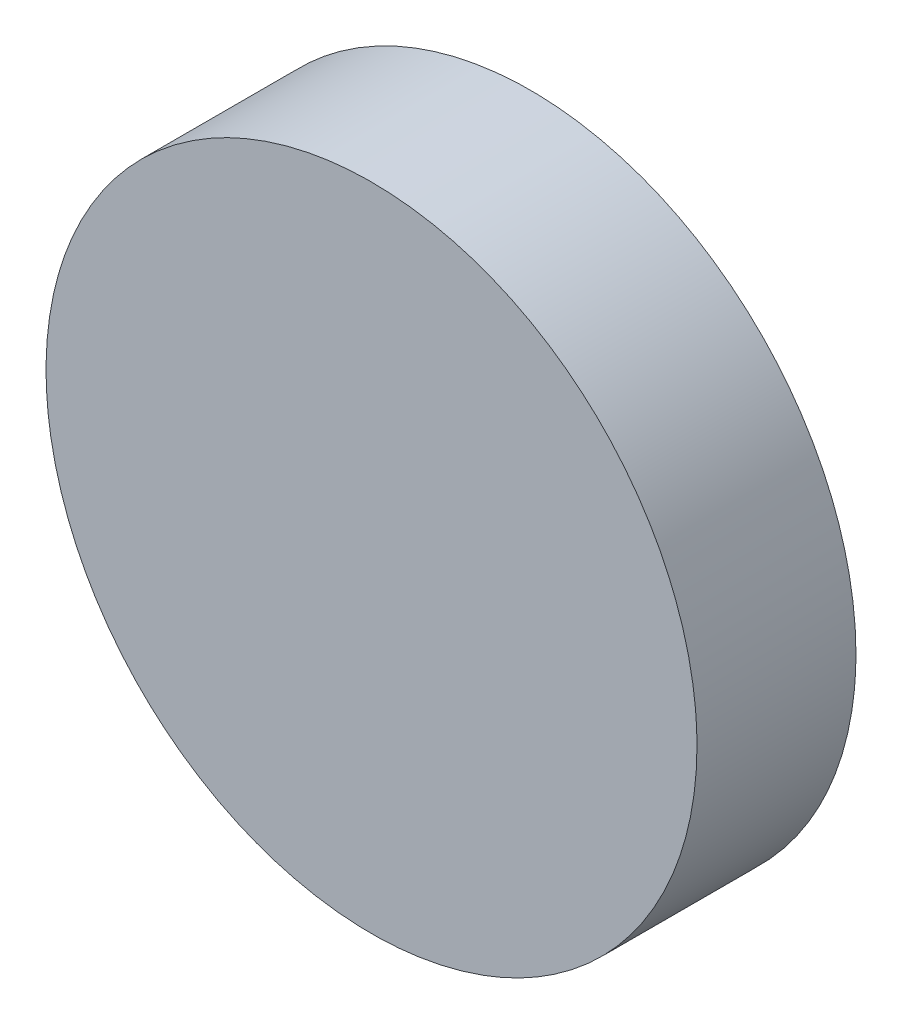
ISO-10303-21;
HEADER;
FILE_DESCRIPTION(('STEP AP214'),'2;1');
FILE_NAME('part.step','',(''),(''),'','','');
FILE_SCHEMA(('AUTOMOTIVE_DESIGN { 1 0 10303 214 1 1 1 1 }'));
ENDSEC;
DATA;
#1=APPLICATION_CONTEXT('core data for automotive mechanical design processes');
#2=APPLICATION_PROTOCOL_DEFINITION('international standard','automotive_design',2000,#1);
#3=PRODUCT_CONTEXT('',#1,'mechanical');
#4=PRODUCT('Part','Part','',(#3));
#5=PRODUCT_RELATED_PRODUCT_CATEGORY('part','',(#4));
#6=PRODUCT_DEFINITION_FORMATION('','',#4);
#7=PRODUCT_DEFINITION_CONTEXT('part definition',#1,'design');
#8=PRODUCT_DEFINITION('design','',#6,#7);
#9=PRODUCT_DEFINITION_SHAPE('','',#8);
#10=(LENGTH_UNIT() NAMED_UNIT(*) SI_UNIT(.MILLI.,.METRE.));
#11=(NAMED_UNIT(*) PLANE_ANGLE_UNIT() SI_UNIT($,.RADIAN.));
#12=(NAMED_UNIT(*) SI_UNIT($,.STERADIAN.) SOLID_ANGLE_UNIT());
#13=UNCERTAINTY_MEASURE_WITH_UNIT(LENGTH_MEASURE(1.E-05),#10,'distance_accuracy_value','');
#14=(GEOMETRIC_REPRESENTATION_CONTEXT(3) GLOBAL_UNCERTAINTY_ASSIGNED_CONTEXT((#13)) GLOBAL_UNIT_ASSIGNED_CONTEXT((#10,
#11,#12)) REPRESENTATION_CONTEXT('',''));
#15=CARTESIAN_POINT('',(0.,0.,0.));
#16=DIRECTION('',(0.,0.,1.));
#17=DIRECTION('',(1.,0.,0.));
#18=AXIS2_PLACEMENT_3D('',#15,#16,#17);
#19=CARTESIAN_POINT('',(15.3503636056791,-25.6015554934087,33.9946065263124));
#20=CARTESIAN_POINT('',(15.3503636056791,-25.3323875266763,33.9946065263124));
#21=CARTESIAN_POINT('',(15.2432819307081,-24.7940515932114,33.9946065263124));
#22=CARTESIAN_POINT('',(14.7858677148132,-24.109482841778,33.9946065263124));
#23=CARTESIAN_POINT('',(14.1012989633798,-23.6520686258831,33.9946065263124));
#24=CARTESIAN_POINT('',(13.2937950631825,-23.4914461134265,33.9946065263124));
#25=CARTESIAN_POINT('',(12.4862911629851,-23.6520686258831,33.9946065263124));
#26=CARTESIAN_POINT('',(11.8017224115517,-24.109482841778,33.9946065263124));
#27=CARTESIAN_POINT('',(11.3443081956568,-24.7940515932114,33.9946065263124));
#28=CARTESIAN_POINT('',(11.1836856832003,-25.6015554934087,33.9946065263124));
#29=CARTESIAN_POINT('',(11.3443081956568,-26.4090593936061,33.9946065263124));
#30=CARTESIAN_POINT('',(11.8017224115517,-27.0936281450395,33.9946065263124));
#31=CARTESIAN_POINT('',(12.4862911629851,-27.5510423609344,33.9946065263124));
#32=CARTESIAN_POINT('',(13.2937950631825,-27.7116648733909,33.9946065263124));
#33=CARTESIAN_POINT('',(14.1012989633798,-27.5510423609344,33.9946065263124));
#34=CARTESIAN_POINT('',(14.7858677148132,-27.0936281450395,33.9946065263124));
#35=CARTESIAN_POINT('',(15.2432819307081,-26.4090593936061,33.9946065263124));
#36=CARTESIAN_POINT('',(15.3503636056791,-25.8707234601412,33.9946065263124));
#37=CARTESIAN_POINT('',(15.3503636056791,-25.6015554934087,33.9946065263124));
#38=B_SPLINE_CURVE_WITH_KNOTS('',3,(#19,#20,#21,#22,#23,#24,#25,#26,#27,#28,#29,#30,#31,#32,#33,
#34,#35,#36,#37),.UNSPECIFIED.,.T.,.F.,(4,1,1,1,1,1,1,1,1,1,1,1,1,1,1,1,4),(0.,0.0625,0.125,
0.1875,0.25,0.3125,0.375,0.4375,0.5,0.5625,0.625,0.6875,0.75,0.8125,0.875,0.9375,1.),.UNSPECIFIED.);
#39=DIRECTION('',(0.,0.,1.));
#40=VECTOR('',#39,1.);
#41=SURFACE_OF_LINEAR_EXTRUSION('',#38,#40);
#42=CARTESIAN_POINT('',(15.3503636056791,-25.6015554934087,33.9946065263124));
#43=CARTESIAN_POINT('',(15.3503636056791,-25.3323875266763,33.9946065263124));
#44=CARTESIAN_POINT('',(15.2432819307081,-24.7940515932114,33.9946065263124));
#45=CARTESIAN_POINT('',(14.7858677148132,-24.109482841778,33.9946065263124));
#46=CARTESIAN_POINT('',(14.1012989633798,-23.6520686258831,33.9946065263124));
#47=CARTESIAN_POINT('',(13.2937950631825,-23.4914461134265,33.9946065263124));
#48=CARTESIAN_POINT('',(12.4862911629851,-23.6520686258831,33.9946065263124));
#49=CARTESIAN_POINT('',(11.8017224115517,-24.109482841778,33.9946065263124));
#50=CARTESIAN_POINT('',(11.3443081956568,-24.7940515932114,33.9946065263124));
#51=CARTESIAN_POINT('',(11.1836856832003,-25.6015554934087,33.9946065263124));
#52=CARTESIAN_POINT('',(11.3443081956568,-26.4090593936061,33.9946065263124));
#53=CARTESIAN_POINT('',(11.8017224115517,-27.0936281450395,33.9946065263124));
#54=CARTESIAN_POINT('',(12.4862911629851,-27.5510423609344,33.9946065263124));
#55=CARTESIAN_POINT('',(13.2937950631825,-27.7116648733909,33.9946065263124));
#56=CARTESIAN_POINT('',(14.1012989633798,-27.5510423609344,33.9946065263124));
#57=CARTESIAN_POINT('',(14.7858677148132,-27.0936281450395,33.9946065263124));
#58=CARTESIAN_POINT('',(15.2432819307081,-26.4090593936061,33.9946065263124));
#59=CARTESIAN_POINT('',(15.3503636056791,-25.8707234601412,33.9946065263124));
#60=CARTESIAN_POINT('',(15.3503636056791,-25.6015554934087,33.9946065263124));
#61=B_SPLINE_CURVE_WITH_KNOTS('',3,(#42,#43,#44,#45,#46,#47,#48,#49,#50,#51,#52,#53,#54,#55,#56,
#57,#58,#59,#60),.UNSPECIFIED.,.T.,.F.,(4,1,1,1,1,1,1,1,1,1,1,1,1,1,1,1,4),(0.,0.0625,0.125,
0.1875,0.25,0.3125,0.375,0.4375,0.5,0.5625,0.625,0.6875,0.75,0.8125,0.875,0.9375,1.),.UNSPECIFIED.);
#62=CARTESIAN_POINT('',(15.3503636056791,-25.6015554934087,33.9946065263124));
#63=VERTEX_POINT('',#62);
#64=EDGE_CURVE('E9',#63,#63,#61,.T.);
#65=ORIENTED_EDGE('',*,*,#64,.T.);
#66=EDGE_LOOP('',(#65));
#67=FACE_BOUND('',#66,.T.);
#68=CARTESIAN_POINT('',(15.3503636056791,-25.6015554934087,34.9990000000068));
#69=CARTESIAN_POINT('',(15.3503636300379,-25.6352022831517,34.9990000000068));
#70=CARTESIAN_POINT('',(15.3495269935284,-25.6688483745142,34.9990000000068));
#71=CARTESIAN_POINT('',(15.346196586481,-25.7360605285312,34.9990000000068));
#72=CARTESIAN_POINT('',(15.3437027184522,-25.7696265863609,34.9990000000068));
#73=CARTESIAN_POINT('',(15.3370738124356,-25.8365983613763,34.9990000000068));
#74=CARTESIAN_POINT('',(15.3329386618263,-25.8700040673998,34.9990000000068));
#75=CARTESIAN_POINT('',(15.323043098035,-25.9365753108456,34.9990000000068));
#76=CARTESIAN_POINT('',(15.3172826147575,-25.9697408378466,34.9990000000068));
#77=CARTESIAN_POINT('',(15.3041522287672,-26.0357517513031,34.9990000000068));
#78=CARTESIAN_POINT('',(15.2967823260544,-26.0685971377587,34.9990000000068));
#79=CARTESIAN_POINT('',(15.2804489160935,-26.1338878282125,34.9990000000068));
#80=CARTESIAN_POINT('',(15.2714854775938,-26.1663331494057,34.9990000000068));
#81=CARTESIAN_POINT('',(15.2519808248614,-26.2307437222432,34.9990000000068));
#82=CARTESIAN_POINT('',(15.241439718946,-26.2627090066795,34.9990000000068));
#83=CARTESIAN_POINT('',(15.218795541295,-26.3260796262804,34.9990000000068));
#84=CARTESIAN_POINT('',(15.2066925614854,-26.3574849942758,34.9990000000068));
#85=CARTESIAN_POINT('',(15.180940732118,-26.4196554100151,34.9990000000068));
#86=CARTESIAN_POINT('',(15.1672918825602,-26.4504204577589,34.9990000000068));
#87=CARTESIAN_POINT('',(15.1384939392235,-26.5112421042255,34.9990000000068));
#88=CARTESIAN_POINT('',(15.1233447572282,-26.5412986611616,34.9990000000068));
#89=CARTESIAN_POINT('',(15.0915914768304,-26.6006356860102,34.9990000000068));
#90=CARTESIAN_POINT('',(15.0749872786485,-26.6299161005181,34.9990000000068));
#91=CARTESIAN_POINT('',(15.0403692527882,-26.6876330561693,34.9990000000068));
#92=CARTESIAN_POINT('',(15.0223553643385,-26.716069560859,34.9990000000068));
#93=CARTESIAN_POINT('',(14.9849631878921,-26.7720309076073,34.9990000000068));
#94=CARTESIAN_POINT('',(14.9655848998955,-26.799555749666,34.9990000000068));
#95=CARTESIAN_POINT('',(14.925509130848,-26.8536259579087,34.9990000000068));
#96=CARTESIAN_POINT('',(14.9048117067321,-26.8801713662879,34.9990000000068));
#97=CARTESIAN_POINT('',(14.8621428982873,-26.9322148684723,34.9990000000068));
#98=CARTESIAN_POINT('',(14.8401716014817,-26.9577130340248,34.9990000000068));
#99=CARTESIAN_POINT('',(14.7950002229733,-27.0075943008858,34.9990000000068));
#100=CARTESIAN_POINT('',(14.7718002136353,-27.0319774677046,34.9990000000068));
#101=CARTESIAN_POINT('',(14.7242170374783,-27.0795606438615,34.9990000000068));
#102=CARTESIAN_POINT('',(14.6998338706595,-27.1027606531996,34.9990000000068));
#103=CARTESIAN_POINT('',(14.6499526037985,-27.147932031708,34.9990000000068));
#104=CARTESIAN_POINT('',(14.624454438246,-27.1699033285136,34.9990000000068));
#105=CARTESIAN_POINT('',(14.5724109360616,-27.2125721369584,34.9990000000068));
#106=CARTESIAN_POINT('',(14.5458655276824,-27.2332695610743,34.9990000000068));
#107=CARTESIAN_POINT('',(14.4917953194397,-27.2733453301218,34.9990000000068));
#108=CARTESIAN_POINT('',(14.464270477381,-27.2927236181184,34.9990000000068));
#109=CARTESIAN_POINT('',(14.4083091306328,-27.3301157945648,34.9990000000068));
#110=CARTESIAN_POINT('',(14.3798726259432,-27.3481296830145,34.9990000000068));
#111=CARTESIAN_POINT('',(14.3221556702916,-27.3827477088748,34.9990000000068));
#112=CARTESIAN_POINT('',(14.2928752557831,-27.3993519070567,34.9990000000068));
#113=CARTESIAN_POINT('',(14.2335382309361,-27.4311051874545,34.9990000000068));
#114=CARTESIAN_POINT('',(14.2034816740021,-27.4462543694499,34.9990000000068));
#115=CARTESIAN_POINT('',(14.1426600275298,-27.4750523127863,34.9990000000068));
#116=CARTESIAN_POINT('',(14.1118949797781,-27.4887011623436,34.9990000000068));
#117=CARTESIAN_POINT('',(14.0497245640602,-27.5144529917123,34.9990000000068));
#118=CARTESIAN_POINT('',(14.0183191960941,-27.5265559715237,34.9990000000068));
#119=CARTESIAN_POINT('',(13.9549485764132,-27.5492001491698,34.9990000000068));
#120=CARTESIAN_POINT('',(13.9229832918677,-27.5597412550786,34.9990000000068));
#121=CARTESIAN_POINT('',(13.8585727193287,-27.5792459078291,34.9990000000068));
#122=CARTESIAN_POINT('',(13.8261273985432,-27.5882093463535,34.9990000000068));
#123=CARTESIAN_POINT('',(13.7608367069754,-27.604542756247,34.9990000000068));
#124=CARTESIAN_POINT('',(13.7279913189978,-27.6119126588679,34.9990000000068));
#125=CARTESIAN_POINT('',(13.6619804096993,-27.6250430451094,34.9990000000068));
#126=CARTESIAN_POINT('',(13.6288148883783,-27.63080352873,34.9990000000068));
#127=CARTESIAN_POINT('',(13.5622436294149,-27.6406990915838,34.9990000000068));
#128=CARTESIAN_POINT('',(13.5288379021952,-27.6448342409127,34.9990000000068));
#129=CARTESIAN_POINT('',(13.4618661850874,-27.6514631504275,34.9990000000068));
#130=CARTESIAN_POINT('',(13.4283002063548,-27.6539570232348,34.9990000000068));
#131=CARTESIAN_POINT('',(13.3610878362444,-27.6572874172275,34.9990000000068));
#132=CARTESIAN_POINT('',(13.3274414497134,-27.6581240359054,34.9990000000068));
#133=CARTESIAN_POINT('',(13.2601486766515,-27.6581240359054,34.9990000000068));
#134=CARTESIAN_POINT('',(13.2265022901205,-27.6572874172276,34.9990000000068));
#135=CARTESIAN_POINT('',(13.1592899200101,-27.6539570232348,34.9990000000068));
#136=CARTESIAN_POINT('',(13.1257239412775,-27.6514631504275,34.9990000000068));
#137=CARTESIAN_POINT('',(13.0587522241697,-27.6448342409127,34.9990000000068));
#138=CARTESIAN_POINT('',(13.02534649695,-27.6406990915838,34.9990000000068));
#139=CARTESIAN_POINT('',(12.9587752379866,-27.63080352873,34.9990000000068));
#140=CARTESIAN_POINT('',(12.9256097166656,-27.6250430451094,34.9990000000068));
#141=CARTESIAN_POINT('',(12.8595988073671,-27.6119126588679,34.9990000000068));
#142=CARTESIAN_POINT('',(12.8267534193895,-27.604542756247,34.9990000000068));
#143=CARTESIAN_POINT('',(12.7614627278217,-27.5882093463535,34.9990000000068));
#144=CARTESIAN_POINT('',(12.7290174070362,-27.5792459078291,34.9990000000068));
#145=CARTESIAN_POINT('',(12.6646068344972,-27.5597412550786,34.9990000000068));
#146=CARTESIAN_POINT('',(12.6326415499517,-27.5492001491698,34.9990000000068));
#147=CARTESIAN_POINT('',(12.5692709302708,-27.5265559715237,34.9990000000068));
#148=CARTESIAN_POINT('',(12.5378655623047,-27.5144529917123,34.9990000000068));
#149=CARTESIAN_POINT('',(12.4756951465868,-27.4887011623436,34.9990000000068));
#150=CARTESIAN_POINT('',(12.4449300988351,-27.4750523127863,34.9990000000068));
#151=CARTESIAN_POINT('',(12.3841084523628,-27.4462543694499,34.9990000000068));
#152=CARTESIAN_POINT('',(12.3540518954288,-27.4311051874545,34.9990000000068));
#153=CARTESIAN_POINT('',(12.2947148705818,-27.3993519070567,34.9990000000068));
#154=CARTESIAN_POINT('',(12.2654344560733,-27.3827477088748,34.9990000000068));
#155=CARTESIAN_POINT('',(12.2077175004217,-27.3481296830145,34.9990000000068));
#156=CARTESIAN_POINT('',(12.1792809957321,-27.3301157945648,34.9990000000068));
#157=CARTESIAN_POINT('',(12.1233196489839,-27.2927236181184,34.9990000000068));
#158=CARTESIAN_POINT('',(12.0957948069252,-27.2733453301217,34.9990000000068));
#159=CARTESIAN_POINT('',(12.0417245986825,-27.2332695610743,34.9990000000068));
#160=CARTESIAN_POINT('',(12.0151791903033,-27.2125721369584,34.9990000000068));
#161=CARTESIAN_POINT('',(11.9631356881189,-27.1699033285136,34.9990000000068));
#162=CARTESIAN_POINT('',(11.9376375225664,-27.147932031708,34.9990000000068));
#163=CARTESIAN_POINT('',(11.8877562557054,-27.1027606531996,34.9990000000068));
#164=CARTESIAN_POINT('',(11.8633730888866,-27.0795606438615,34.9990000000068));
#165=CARTESIAN_POINT('',(11.8157899127297,-27.0319774677046,34.9990000000068));
#166=CARTESIAN_POINT('',(11.7925899033916,-27.0075943008857,34.9990000000068));
#167=CARTESIAN_POINT('',(11.7474185248832,-26.9577130340248,34.9990000000068));
#168=CARTESIAN_POINT('',(11.7254472280776,-26.9322148684723,34.9990000000068));
#169=CARTESIAN_POINT('',(11.6827784196328,-26.8801713662879,34.9990000000068));
#170=CARTESIAN_POINT('',(11.6620809955169,-26.8536259579087,34.9990000000068));
#171=CARTESIAN_POINT('',(11.6220052264694,-26.799555749666,34.9990000000068));
#172=CARTESIAN_POINT('',(11.6026269384728,-26.7720309076073,34.9990000000068));
#173=CARTESIAN_POINT('',(11.5652347620264,-26.716069560859,34.9990000000068));
#174=CARTESIAN_POINT('',(11.5472208735767,-26.6876330561695,34.9990000000068));
#175=CARTESIAN_POINT('',(11.5126028477164,-26.6299161005179,34.9990000000068));
#176=CARTESIAN_POINT('',(11.4959986495345,-26.6006356860094,34.9990000000068));
#177=CARTESIAN_POINT('',(11.4642453691367,-26.5412986611624,34.9990000000068));
#178=CARTESIAN_POINT('',(11.4490961871413,-26.5112421042283,34.9990000000068));
#179=CARTESIAN_POINT('',(11.4202982438049,-26.450420457756,34.9990000000068));
#180=CARTESIAN_POINT('',(11.4066493942476,-26.4196554100043,34.9990000000068));
#181=CARTESIAN_POINT('',(11.3808975648789,-26.3574849942865,34.9990000000068));
#182=CARTESIAN_POINT('',(11.3687945850675,-26.3260796263204,34.9990000000068));
#183=CARTESIAN_POINT('',(11.3461504074214,-26.2627090066395,34.9990000000068));
#184=CARTESIAN_POINT('',(11.3356093015126,-26.2307437220939,34.9990000000068));
#185=CARTESIAN_POINT('',(11.316104648762,-26.1663331495549,34.9990000000068));
#186=CARTESIAN_POINT('',(11.3071412102377,-26.1338878287695,34.9990000000068));
#187=CARTESIAN_POINT('',(11.2908078003441,-26.0685971372016,34.9990000000068));
#188=CARTESIAN_POINT('',(11.2834378977233,-26.0357517492241,34.9990000000068));
#189=CARTESIAN_POINT('',(11.2703075114818,-25.9697408399255,34.9990000000068));
#190=CARTESIAN_POINT('',(11.2645470278612,-25.9365753186046,34.9990000000068));
#191=CARTESIAN_POINT('',(11.2546514650073,-25.8700040596412,34.9990000000068));
#192=CARTESIAN_POINT('',(11.2505163156785,-25.8365983324215,34.9990000000068));
#193=CARTESIAN_POINT('',(11.2438874061636,-25.7696266153137,34.9990000000068));
#194=CARTESIAN_POINT('',(11.2413935333564,-25.7360606365811,34.9990000000068));
#195=CARTESIAN_POINT('',(11.2380631393636,-25.6688482664707,34.9990000000068));
#196=CARTESIAN_POINT('',(11.2372265206858,-25.6352018799397,34.9990000000068));
#197=CARTESIAN_POINT('',(11.2372265206858,-25.5679091068778,34.9990000000068));
#198=CARTESIAN_POINT('',(11.2380631393636,-25.5342627203468,34.9990000000068));
#199=CARTESIAN_POINT('',(11.2413935333564,-25.4670503502364,34.9990000000068));
#200=CARTESIAN_POINT('',(11.2438874061636,-25.4334843715037,34.9990000000068));
#201=CARTESIAN_POINT('',(11.2505163156785,-25.366512654396,34.9990000000068));
#202=CARTESIAN_POINT('',(11.2546514650073,-25.3331069271762,34.9990000000068));
#203=CARTESIAN_POINT('',(11.2645470278612,-25.2665356682129,34.9990000000068));
#204=CARTESIAN_POINT('',(11.2703075114818,-25.2333701468919,34.9990000000068));
#205=CARTESIAN_POINT('',(11.2834378977233,-25.1673592375934,34.9990000000068));
#206=CARTESIAN_POINT('',(11.2908078003441,-25.1345138496158,34.9990000000068));
#207=CARTESIAN_POINT('',(11.3071412102377,-25.069223158048,34.9990000000068));
#208=CARTESIAN_POINT('',(11.316104648762,-25.0367778372625,34.9990000000068));
#209=CARTESIAN_POINT('',(11.3356093015126,-24.9723672647235,34.9990000000068));
#210=CARTESIAN_POINT('',(11.3461504074214,-24.940401980178,34.9990000000068));
#211=CARTESIAN_POINT('',(11.3687945850675,-24.8770313604971,34.9990000000068));
#212=CARTESIAN_POINT('',(11.3808975648789,-24.845625992531,34.9990000000068));
#213=CARTESIAN_POINT('',(11.4066493942476,-24.7834555768131,34.9990000000068));
#214=CARTESIAN_POINT('',(11.4202982438049,-24.7526905290614,34.9990000000068));
#215=CARTESIAN_POINT('',(11.4490961871413,-24.6918688825891,34.9990000000068));
#216=CARTESIAN_POINT('',(11.4642453691367,-24.6618123256551,34.9990000000068));
#217=CARTESIAN_POINT('',(11.4959986495345,-24.6024753008081,34.9990000000068));
#218=CARTESIAN_POINT('',(11.5126028477164,-24.5731948862996,34.9990000000068));
#219=CARTESIAN_POINT('',(11.5472208735767,-24.515477930648,34.9990000000068));
#220=CARTESIAN_POINT('',(11.5652347620264,-24.4870414259584,34.9990000000068));
#221=CARTESIAN_POINT('',(11.6026269384728,-24.4310800792102,34.9990000000068));
#222=CARTESIAN_POINT('',(11.6220052264694,-24.4035552371515,34.9990000000068));
#223=CARTESIAN_POINT('',(11.6620809955169,-24.3494850289088,34.9990000000068));
#224=CARTESIAN_POINT('',(11.6827784196328,-24.3229396205296,34.9990000000068));
#225=CARTESIAN_POINT('',(11.7254472280776,-24.2708961183452,34.9990000000068));
#226=CARTESIAN_POINT('',(11.7474185248832,-24.2453979527927,34.9990000000068));
#227=CARTESIAN_POINT('',(11.7925899033916,-24.1955166859317,34.9990000000068));
#228=CARTESIAN_POINT('',(11.8157899127297,-24.1711335191129,34.9990000000068));
#229=CARTESIAN_POINT('',(11.8633730888866,-24.1235503429559,34.9990000000068));
#230=CARTESIAN_POINT('',(11.8877562557054,-24.1003503336178,34.9990000000068));
#231=CARTESIAN_POINT('',(11.9376375225664,-24.0551789551095,34.9990000000068));
#232=CARTESIAN_POINT('',(11.9631356881189,-24.0332076583039,34.9990000000068));
#233=CARTESIAN_POINT('',(12.0151791903033,-23.9905388498591,34.9990000000068));
#234=CARTESIAN_POINT('',(12.0417245986825,-23.9698414257432,34.9990000000068));
#235=CARTESIAN_POINT('',(12.0957948069252,-23.9297656566957,34.9990000000068));
#236=CARTESIAN_POINT('',(12.1233196489839,-23.9103873686991,34.9990000000068));
#237=CARTESIAN_POINT('',(12.1792809957321,-23.8729951922527,34.9990000000068));
#238=CARTESIAN_POINT('',(12.2077175004217,-23.854981303803,34.9990000000068));
#239=CARTESIAN_POINT('',(12.2654344560733,-23.8203632779427,34.9990000000068));
#240=CARTESIAN_POINT('',(12.2947148705818,-23.8037590797608,34.9990000000068));
#241=CARTESIAN_POINT('',(12.3540518954288,-23.7720057993629,34.9990000000068));
#242=CARTESIAN_POINT('',(12.3841084523628,-23.7568566173675,34.9990000000068));
#243=CARTESIAN_POINT('',(12.4449300988351,-23.7280586740312,34.9990000000068));
#244=CARTESIAN_POINT('',(12.4756951465868,-23.7144098244738,34.9990000000068));
#245=CARTESIAN_POINT('',(12.5378655623047,-23.6886579951051,34.9990000000068));
#246=CARTESIAN_POINT('',(12.5692709302708,-23.6765550152938,34.9990000000068));
#247=CARTESIAN_POINT('',(12.6326415499517,-23.6539108376476,34.9990000000068));
#248=CARTESIAN_POINT('',(12.6646068344973,-23.6433697317388,34.9990000000068));
#249=CARTESIAN_POINT('',(12.7290174070362,-23.6238650789883,34.9990000000068));
#250=CARTESIAN_POINT('',(12.7614627278217,-23.614901640464,34.9990000000068));
#251=CARTESIAN_POINT('',(12.8267534193895,-23.5985682305704,34.9990000000068));
#252=CARTESIAN_POINT('',(12.8595988073671,-23.5911983279495,34.9990000000068));
#253=CARTESIAN_POINT('',(12.9256097166656,-23.5780679417081,34.9990000000068));
#254=CARTESIAN_POINT('',(12.9587752379866,-23.5723074580875,34.9990000000068));
#255=CARTESIAN_POINT('',(13.02534649695,-23.5624118952336,34.9990000000068));
#256=CARTESIAN_POINT('',(13.0587522241697,-23.5582767459048,34.9990000000068));
#257=CARTESIAN_POINT('',(13.1257239412775,-23.5516478363899,34.9990000000068));
#258=CARTESIAN_POINT('',(13.1592899200101,-23.5491539635827,34.9990000000068));
#259=CARTESIAN_POINT('',(13.2265022901205,-23.5458235695899,34.9990000000068));
#260=CARTESIAN_POINT('',(13.2601486766515,-23.5449869509121,34.9990000000068));
#261=CARTESIAN_POINT('',(13.3274414497134,-23.5449869509121,34.9990000000068));
#262=CARTESIAN_POINT('',(13.3610878362444,-23.5458235695899,34.9990000000068));
#263=CARTESIAN_POINT('',(13.4283002063548,-23.5491539635827,34.9990000000068));
#264=CARTESIAN_POINT('',(13.4618661850874,-23.5516478363899,34.9990000000068));
#265=CARTESIAN_POINT('',(13.5288379021952,-23.5582767459048,34.9990000000068));
#266=CARTESIAN_POINT('',(13.5622436294149,-23.5624118952336,34.9990000000068));
#267=CARTESIAN_POINT('',(13.6288148883783,-23.5723074580875,34.9990000000068));
#268=CARTESIAN_POINT('',(13.6619804096993,-23.5780679417081,34.9990000000068));
#269=CARTESIAN_POINT('',(13.7279913189978,-23.5911983279495,34.9990000000068));
#270=CARTESIAN_POINT('',(13.7608367069754,-23.5985682305704,34.9990000000068));
#271=CARTESIAN_POINT('',(13.8261273985432,-23.614901640464,34.9990000000068));
#272=CARTESIAN_POINT('',(13.8585727193287,-23.6238650789883,34.9990000000068));
#273=CARTESIAN_POINT('',(13.9229832918677,-23.6433697317388,34.9990000000068));
#274=CARTESIAN_POINT('',(13.9549485764132,-23.6539108376476,34.9990000000068));
#275=CARTESIAN_POINT('',(14.0183191960941,-23.6765550152938,34.9990000000068));
#276=CARTESIAN_POINT('',(14.0497245640602,-23.6886579951051,34.9990000000068));
#277=CARTESIAN_POINT('',(14.1118949797781,-23.7144098244738,34.9990000000068));
#278=CARTESIAN_POINT('',(14.1426600275298,-23.7280586740312,34.9990000000068));
#279=CARTESIAN_POINT('',(14.2034816740021,-23.7568566173675,34.9990000000068));
#280=CARTESIAN_POINT('',(14.2335382309361,-23.7720057993629,34.9990000000068));
#281=CARTESIAN_POINT('',(14.2928752557831,-23.8037590797608,34.9990000000068));
#282=CARTESIAN_POINT('',(14.3221556702916,-23.8203632779427,34.9990000000068));
#283=CARTESIAN_POINT('',(14.3798726259432,-23.854981303803,34.9990000000068));
#284=CARTESIAN_POINT('',(14.4083091306328,-23.8729951922527,34.9990000000068));
#285=CARTESIAN_POINT('',(14.464270477381,-23.9103873686991,34.9990000000068));
#286=CARTESIAN_POINT('',(14.4917953194397,-23.9297656566957,34.9990000000068));
#287=CARTESIAN_POINT('',(14.5458655276824,-23.9698414257432,34.9990000000068));
#288=CARTESIAN_POINT('',(14.5724109360616,-23.9905388498591,34.9990000000068));
#289=CARTESIAN_POINT('',(14.624454438246,-24.0332076583039,34.9990000000068));
#290=CARTESIAN_POINT('',(14.6499526037985,-24.0551789551095,34.9990000000068));
#291=CARTESIAN_POINT('',(14.6998338706595,-24.1003503336179,34.9990000000068));
#292=CARTESIAN_POINT('',(14.7242170374783,-24.1235503429559,34.9990000000068));
#293=CARTESIAN_POINT('',(14.7718002136353,-24.1711335191129,34.9990000000068));
#294=CARTESIAN_POINT('',(14.7950002229733,-24.1955166859317,34.9990000000068));
#295=CARTESIAN_POINT('',(14.8401716014817,-24.2453979527927,34.9990000000068));
#296=CARTESIAN_POINT('',(14.8621428982873,-24.2708961183452,34.9990000000068));
#297=CARTESIAN_POINT('',(14.9048117067321,-24.3229396205296,34.9990000000068));
#298=CARTESIAN_POINT('',(14.925509130848,-24.3494850289088,34.9990000000068));
#299=CARTESIAN_POINT('',(14.9655848998955,-24.4035552371515,34.9990000000068));
#300=CARTESIAN_POINT('',(14.9849631878921,-24.4310800792102,34.9990000000068));
#301=CARTESIAN_POINT('',(15.0223553643385,-24.4870414259585,34.9990000000068));
#302=CARTESIAN_POINT('',(15.0403692527882,-24.5154779306482,34.9990000000068));
#303=CARTESIAN_POINT('',(15.0749872786485,-24.5731948862994,34.9990000000068));
#304=CARTESIAN_POINT('',(15.0915914768304,-24.6024753008073,34.9990000000068));
#305=CARTESIAN_POINT('',(15.1233447572282,-24.6618123256558,34.9990000000068));
#306=CARTESIAN_POINT('',(15.1384939392235,-24.691868882592,34.9990000000068));
#307=CARTESIAN_POINT('',(15.1672918825602,-24.7526905290586,34.9990000000068));
#308=CARTESIAN_POINT('',(15.180940732118,-24.7834555768024,34.9990000000068));
#309=CARTESIAN_POINT('',(15.2066925614854,-24.8456259925417,34.9990000000068));
#310=CARTESIAN_POINT('',(15.218795541295,-24.8770313605371,34.9990000000068));
#311=CARTESIAN_POINT('',(15.241439718946,-24.940401980138,34.9990000000068));
#312=CARTESIAN_POINT('',(15.2519808248614,-24.9723672645743,34.9990000000068));
#313=CARTESIAN_POINT('',(15.2714854775939,-25.0367778374118,34.9990000000068));
#314=CARTESIAN_POINT('',(15.2804489160935,-25.069223158605,34.9990000000068));
#315=CARTESIAN_POINT('',(15.2967823260544,-25.1345138490588,34.9990000000068));
#316=CARTESIAN_POINT('',(15.3041522287672,-25.1673592355144,34.9990000000068));
#317=CARTESIAN_POINT('',(15.3172826147575,-25.2333701489709,34.9990000000068));
#318=CARTESIAN_POINT('',(15.323043098035,-25.2665356759718,34.9990000000068));
#319=CARTESIAN_POINT('',(15.3329386618263,-25.3331069194177,34.9990000000068));
#320=CARTESIAN_POINT('',(15.3370738124356,-25.3665126254411,34.9990000000068));
#321=CARTESIAN_POINT('',(15.3437027184522,-25.4334844004566,34.9990000000068));
#322=CARTESIAN_POINT('',(15.346196586481,-25.4670504582863,34.9990000000068));
#323=CARTESIAN_POINT('',(15.3495269935284,-25.5342626123033,34.9990000000068));
#324=CARTESIAN_POINT('',(15.3503636300379,-25.5679087036658,34.9990000000068));
#325=CARTESIAN_POINT('',(15.3503636056791,-25.6015554934087,34.9990000000068));
#326=B_SPLINE_CURVE_WITH_KNOTS('',3,(#68,#69,#70,#71,#72,#73,#74,#75,#76,#77,#78,#79,#80,#81,
#82,#83,#84,#85,#86,#87,#88,#89,#90,#91,#92,#93,#94,#95,#96,#97,#98,#99,#100,#101,#102,#103,
#104,#105,#106,#107,#108,#109,#110,#111,#112,#113,#114,#115,#116,#117,#118,#119,#120,#121,#122,
#123,#124,#125,#126,#127,#128,#129,#130,#131,#132,#133,#134,#135,#136,#137,#138,#139,#140,#141,
#142,#143,#144,#145,#146,#147,#148,#149,#150,#151,#152,#153,#154,#155,#156,#157,#158,#159,#160,
#161,#162,#163,#164,#165,#166,#167,#168,#169,#170,#171,#172,#173,#174,#175,#176,#177,#178,#179,
#180,#181,#182,#183,#184,#185,#186,#187,#188,#189,#190,#191,#192,#193,#194,#195,#196,#197,#198,
#199,#200,#201,#202,#203,#204,#205,#206,#207,#208,#209,#210,#211,#212,#213,#214,#215,#216,#217,
#218,#219,#220,#221,#222,#223,#224,#225,#226,#227,#228,#229,#230,#231,#232,#233,#234,#235,#236,
#237,#238,#239,#240,#241,#242,#243,#244,#245,#246,#247,#248,#249,#250,#251,#252,#253,#254,#255,
#256,#257,#258,#259,#260,#261,#262,#263,#264,#265,#266,#267,#268,#269,#270,#271,#272,#273,#274,
#275,#276,#277,#278,#279,#280,#281,#282,#283,#284,#285,#286,#287,#288,#289,#290,#291,#292,#293,
#294,#295,#296,#297,#298,#299,#300,#301,#302,#303,#304,#305,#306,#307,#308,#309,#310,#311,#312,
#313,#314,#315,#316,#317,#318,#319,#320,#321,#322,#323,#324,#325),.UNSPECIFIED.,.F.,.F.,(4,2,2,
2,2,2,2,2,2,2,2,2,2,2,2,2,2,2,2,2,2,2,2,2,2,2,2,2,2,2,2,2,2,2,2,2,2,2,2,2,2,2,2,2,2,2,2,2,2,2,2,
2,2,2,2,2,2,2,2,2,2,2,2,2,2,2,2,2,2,2,2,2,2,2,2,2,2,2,2,2,2,2,2,2,2,2,2,2,2,2,2,2,2,2,2,2,2,2,2,
2,2,2,2,2,2,2,2,2,2,2,2,2,2,2,2,2,2,2,2,2,2,2,2,2,2,2,2,2,4),(0.,0.100928980478605,
0.201863898895517,0.302805744465613,0.403751944002993,0.504698143540366,0.605639989110463,
0.706574907527376,0.807503888005986,0.908432868484591,1.0093677869015,1.1103096324716,
1.21125583200898,1.31220203154635,1.41314387711645,1.51407879553335,1.61500777601197,
1.71593675649058,1.81687167490748,1.91781352047758,2.01875972001495,2.11970591955233,
2.22064776512243,2.32158268353934,2.42251166401795,2.52344064449656,2.62437556291346,
2.72531740848356,2.82626360802094,2.92720980755831,3.02815165312841,3.12908657154532,
3.23001555202393,3.33094453250254,3.43187945091944,3.53282129648954,3.63376749602692,
3.73471369556429,3.83565554113439,3.93659045955129,4.03751944002991,4.13844842050852,
4.23938333892542,4.34032518449552,4.4412713840329,4.54221758357028,4.64315942914038,
4.74409434755728,4.84502332803589,4.94595230851451,5.04688722693141,5.14782907250151,
5.24877527203889,5.34972147157627,5.45066331714636,5.55159823556327,5.65252721604188,
5.75345619652049,5.85439111493739,5.95533296050749,6.05627916004487,6.15722535958224,
6.25816720515234,6.35910212356925,6.46003110404786,6.56096008452646,6.66189500294337,
6.76283684851348,6.86378304805085,6.96472924758822,7.06567109315832,7.16660601157523,
7.26753499205384,7.36846397253245,7.46939889094935,7.57034073651946,7.67128693605683,
7.77223313559421,7.87317498116431,7.97410989958121,8.07503888005983,8.17596786053844,
8.27690277895534,8.37784462452544,8.47879082406281,8.57973702360019,8.68067886917029,
8.7816137875872,8.88254276806581,8.98347174854442,9.08440666696132,9.18534851253142,
9.2862947120688,9.38724091160617,9.48818275717627,9.58911767559317,9.69004665607179,
9.7909756365504,9.8919105549673,9.9928524005374,10.0937986000748,10.1947447996121,
10.2956866451822,10.3966215635992,10.4975505440778,10.5984795245564,10.6994144429733,
10.8003562885434,10.9013024880808,11.0022486876181,11.1031905331882,11.2041254516051,
11.3050544320838,11.4059834125624,11.5069183309793,11.6078601765494,11.7088063760867,
11.8097525756241,11.9106944211942,12.0116293396111,12.1125583200897,12.2134873005683,
12.3144222189852,12.4153640645553,12.5163102640927,12.6172564636301,12.7181983092002,
12.8191332276171,12.9200622080957),.UNSPECIFIED.);
#327=CARTESIAN_POINT('',(15.3503636056791,-25.6015554934087,34.9990000000068));
#328=VERTEX_POINT('',#327);
#329=EDGE_CURVE('E24',#328,#328,#326,.F.);
#330=ORIENTED_EDGE('',*,*,#329,.F.);
#331=EDGE_LOOP('',(#330));
#332=FACE_BOUND('',#331,.T.);
#333=ADVANCED_FACE('F14',(#67,#332),#41,.T.);
#334=CARTESIAN_POINT('',(-11.7062049368191,2.89844450659127,33.9946065263124));
#335=DIRECTION('',(0.,0.,1.));
#336=DIRECTION('',(0.,-1.,0.));
#337=AXIS2_PLACEMENT_3D('',#334,#335,#336);
#338=PLANE('',#337);
#339=ORIENTED_EDGE('',*,*,#64,.F.);
#340=EDGE_LOOP('',(#339));
#341=FACE_BOUND('',#340,.T.);
#342=ADVANCED_FACE('F62',(#341),#338,.F.);
#343=CARTESIAN_POINT('',(-11.7062049368191,2.89844450659127,34.9990000000068));
#344=DIRECTION('',(0.,0.,1.));
#345=DIRECTION('',(0.,-1.,0.));
#346=AXIS2_PLACEMENT_3D('',#343,#344,#345);
#347=PLANE('',#346);
#348=ORIENTED_EDGE('',*,*,#329,.T.);
#349=EDGE_LOOP('',(#348));
#350=FACE_BOUND('',#349,.T.);
#351=ADVANCED_FACE('F31',(#350),#347,.T.);
#352=CLOSED_SHELL('',(#333,#342,#351));
#353=MANIFOLD_SOLID_BREP('B1',#352);
#354=ADVANCED_BREP_SHAPE_REPRESENTATION('',(#18,#353),#14);
#355=SHAPE_DEFINITION_REPRESENTATION(#9,#354);
ENDSEC;
END-ISO-10303-21;
